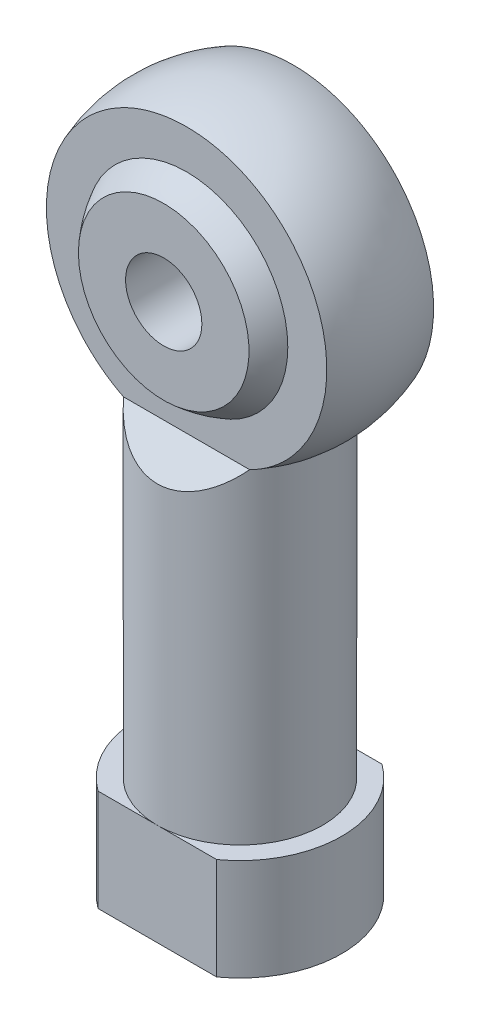
ISO-10303-21;
HEADER;
FILE_DESCRIPTION(('STEP AP214'),'2;1');
FILE_NAME('part.step','',(''),(''),'','','');
FILE_SCHEMA(('AUTOMOTIVE_DESIGN { 1 0 10303 214 1 1 1 1 }'));
ENDSEC;
DATA;
#1=APPLICATION_CONTEXT('core data for automotive mechanical design processes');
#2=APPLICATION_PROTOCOL_DEFINITION('international standard','automotive_design',2000,#1);
#3=PRODUCT_CONTEXT('',#1,'mechanical');
#4=PRODUCT('Part','Part','',(#3));
#5=PRODUCT_RELATED_PRODUCT_CATEGORY('part','',(#4));
#6=PRODUCT_DEFINITION_FORMATION('','',#4);
#7=PRODUCT_DEFINITION_CONTEXT('part definition',#1,'design');
#8=PRODUCT_DEFINITION('design','',#6,#7);
#9=PRODUCT_DEFINITION_SHAPE('','',#8);
#10=(LENGTH_UNIT() NAMED_UNIT(*) SI_UNIT(.MILLI.,.METRE.));
#11=(NAMED_UNIT(*) PLANE_ANGLE_UNIT() SI_UNIT($,.RADIAN.));
#12=(NAMED_UNIT(*) SI_UNIT($,.STERADIAN.) SOLID_ANGLE_UNIT());
#13=UNCERTAINTY_MEASURE_WITH_UNIT(LENGTH_MEASURE(1.E-05),#10,'distance_accuracy_value','');
#14=(GEOMETRIC_REPRESENTATION_CONTEXT(3) GLOBAL_UNCERTAINTY_ASSIGNED_CONTEXT((#13)) GLOBAL_UNIT_ASSIGNED_CONTEXT((#10,
#11,#12)) REPRESENTATION_CONTEXT('',''));
#15=CARTESIAN_POINT('',(0.,0.,0.));
#16=DIRECTION('',(0.,0.,1.));
#17=DIRECTION('',(1.,0.,0.));
#18=AXIS2_PLACEMENT_3D('',#15,#16,#17);
#19=CARTESIAN_POINT('',(-5.90000000000003,0.,2.1));
#20=DIRECTION('',(0.,0.,-1.));
#21=DIRECTION('',(-1.,0.,0.));
#22=AXIS2_PLACEMENT_3D('',#19,#20,#21);
#23=PLANE('',#22);
#24=CARTESIAN_POINT('',(0.,21.7000000000001,2.1));
#25=DIRECTION('',(0.,0.,-1.));
#26=DIRECTION('',(-1.,0.,0.));
#27=AXIS2_PLACEMENT_3D('',#24,#25,#26);
#28=CIRCLE('',#27,5.51361950083612);
#29=CARTESIAN_POINT('',(2.48042335096248,16.7758249421858,2.1));
#30=VERTEX_POINT('',#29);
#31=CARTESIAN_POINT('',(-2.48042335096249,16.7758249421858,2.1));
#32=VERTEX_POINT('',#31);
#33=EDGE_CURVE('E142',#30,#32,#28,.F.);
#34=ORIENTED_EDGE('',*,*,#33,.T.);
#35=DIRECTION('',(1.,0.,0.));
#36=VECTOR('',#35,1.);
#37=CARTESIAN_POINT('',(-5.90000000000003,16.7758249421858,2.1));
#38=LINE('',#37,#36);
#39=EDGE_CURVE('E131',#32,#30,#38,.T.);
#40=ORIENTED_EDGE('',*,*,#39,.T.);
#41=EDGE_LOOP('',(#34,#40));
#42=FACE_BOUND('',#41,.T.);
#43=CARTESIAN_POINT('',(0.,21.7000000000001,2.1));
#44=DIRECTION('',(0.,0.,-1.));
#45=DIRECTION('',(-1.,0.,0.));
#46=AXIS2_PLACEMENT_3D('',#43,#44,#45);
#47=CIRCLE('',#46,3.97994974842648);
#48=CARTESIAN_POINT('',(-3.97994974842648,21.7000000000001,2.1));
#49=VERTEX_POINT('',#48);
#50=EDGE_CURVE('E123',#49,#49,#47,.T.);
#51=ORIENTED_EDGE('',*,*,#50,.T.);
#52=EDGE_LOOP('',(#51));
#53=FACE_BOUND('',#52,.T.);
#54=ADVANCED_FACE('F41',(#42,#53),#23,.F.);
#55=CARTESIAN_POINT('',(-5.90000000000003,9.43791247109279,9.43791247109289));
#56=DIRECTION('',(0.,0.707106781186544,0.707106781186551));
#57=DIRECTION('',(0.,-0.707106781186551,0.707106781186544));
#58=AXIS2_PLACEMENT_3D('',#55,#56,#57);
#59=PLANE('',#58);
#60=CARTESIAN_POINT('',(0.,18.8758249421858,0.));
#61=DIRECTION('',(0.,0.707106781186544,0.707106781186551));
#62=DIRECTION('',(0.,-0.707106781186551,0.707106781186544));
#63=AXIS2_PLACEMENT_3D('',#60,#61,#62);
#64=ELLIPSE('',#63,4.59619407771258,3.25);
#65=EDGE_CURVE('E149',#30,#32,#64,.F.);
#66=ORIENTED_EDGE('',*,*,#65,.F.);
#67=ORIENTED_EDGE('',*,*,#39,.F.);
#68=EDGE_LOOP('',(#66,#67));
#69=FACE_BOUND('',#68,.T.);
#70=ADVANCED_FACE('F195',(#69),#59,.T.);
#71=CARTESIAN_POINT('',(-5.90000000000003,0.,-2.1));
#72=DIRECTION('',(0.,0.,-1.));
#73=DIRECTION('',(-1.,0.,0.));
#74=AXIS2_PLACEMENT_3D('',#71,#72,#73);
#75=PLANE('',#74);
#76=CARTESIAN_POINT('',(0.,21.7000000000001,-2.1));
#77=DIRECTION('',(0.,0.,-1.));
#78=DIRECTION('',(-1.,0.,0.));
#79=AXIS2_PLACEMENT_3D('',#76,#77,#78);
#80=CIRCLE('',#79,3.97994974842648);
#81=CARTESIAN_POINT('',(-3.97994974842648,21.7000000000001,-2.1));
#82=VERTEX_POINT('',#81);
#83=EDGE_CURVE('E145',#82,#82,#80,.T.);
#84=ORIENTED_EDGE('',*,*,#83,.F.);
#85=EDGE_LOOP('',(#84));
#86=FACE_BOUND('',#85,.T.);
#87=DIRECTION('',(1.,0.,0.));
#88=VECTOR('',#87,1.);
#89=CARTESIAN_POINT('',(-5.90000000000003,16.7758249421858,-2.1));
#90=LINE('',#89,#88);
#91=CARTESIAN_POINT('',(-2.48042335096248,16.7758249421858,-2.1));
#92=VERTEX_POINT('',#91);
#93=CARTESIAN_POINT('',(2.48042335096249,16.7758249421858,-2.1));
#94=VERTEX_POINT('',#93);
#95=EDGE_CURVE('E128',#92,#94,#90,.T.);
#96=ORIENTED_EDGE('',*,*,#95,.F.);
#97=CARTESIAN_POINT('',(0.,21.7000000000001,-2.1));
#98=DIRECTION('',(0.,0.,-1.));
#99=DIRECTION('',(-1.,0.,0.));
#100=AXIS2_PLACEMENT_3D('',#97,#98,#99);
#101=CIRCLE('',#100,5.51361950083612);
#102=EDGE_CURVE('E146',#94,#92,#101,.F.);
#103=ORIENTED_EDGE('',*,*,#102,.F.);
#104=EDGE_LOOP('',(#96,#103));
#105=FACE_BOUND('',#104,.T.);
#106=ADVANCED_FACE('F191',(#86,#105),#75,.T.);
#107=CARTESIAN_POINT('',(-5.90000000000003,9.43791247109279,-9.43791247109289));
#108=DIRECTION('',(0.,-0.707106781186544,0.707106781186551));
#109=DIRECTION('',(0.,-0.707106781186551,-0.707106781186544));
#110=AXIS2_PLACEMENT_3D('',#107,#108,#109);
#111=PLANE('',#110);
#112=CARTESIAN_POINT('',(0.,18.8758249421858,0.));
#113=DIRECTION('',(0.,-0.707106781186544,0.707106781186551));
#114=DIRECTION('',(0.,-0.707106781186551,-0.707106781186544));
#115=AXIS2_PLACEMENT_3D('',#112,#113,#114);
#116=ELLIPSE('',#115,4.59619407771258,3.25);
#117=EDGE_CURVE('E151',#94,#92,#116,.F.);
#118=ORIENTED_EDGE('',*,*,#117,.T.);
#119=ORIENTED_EDGE('',*,*,#95,.T.);
#120=EDGE_LOOP('',(#118,#119));
#121=FACE_BOUND('',#120,.T.);
#122=ADVANCED_FACE('F194',(#121),#111,.F.);
#123=CARTESIAN_POINT('',(0.,0.,0.));
#124=DIRECTION('',(0.,-1.,0.));
#125=DIRECTION('',(0.,0.,-1.));
#126=AXIS2_PLACEMENT_3D('',#123,#124,#125);
#127=PLANE('',#126);
#128=CARTESIAN_POINT('',(0.,0.,0.));
#129=DIRECTION('',(0.,-1.,0.));
#130=DIRECTION('',(0.,0.,-1.));
#131=AXIS2_PLACEMENT_3D('',#128,#129,#130);
#132=CIRCLE('',#131,1.24999999999999);
#133=CARTESIAN_POINT('',(0.,0.,-1.24999999999999));
#134=VERTEX_POINT('',#133);
#135=EDGE_CURVE('E113',#134,#134,#132,.T.);
#136=ORIENTED_EDGE('',*,*,#135,.F.);
#137=EDGE_LOOP('',(#136));
#138=FACE_BOUND('',#137,.T.);
#139=CARTESIAN_POINT('',(0.,0.,0.));
#140=DIRECTION('',(0.,-1.,0.));
#141=DIRECTION('',(0.,0.,-1.));
#142=AXIS2_PLACEMENT_3D('',#139,#140,#141);
#143=CIRCLE('',#142,4.);
#144=CARTESIAN_POINT('',(2.33184476327221,0.,-3.25));
#145=VERTEX_POINT('',#144);
#146=CARTESIAN_POINT('',(2.33184476327221,0.,3.25));
#147=VERTEX_POINT('',#146);
#148=EDGE_CURVE('E11',#145,#147,#143,.T.);
#149=ORIENTED_EDGE('',*,*,#148,.T.);
#150=DIRECTION('',(1.,0.,0.));
#151=VECTOR('',#150,1.);
#152=CARTESIAN_POINT('',(-5.90000000000003,0.,3.25));
#153=LINE('',#152,#151);
#154=CARTESIAN_POINT('',(-2.33184476327221,0.,3.25));
#155=VERTEX_POINT('',#154);
#156=EDGE_CURVE('E126',#155,#147,#153,.T.);
#157=ORIENTED_EDGE('',*,*,#156,.F.);
#158=CARTESIAN_POINT('',(-2.33184476327221,0.,-3.25));
#159=VERTEX_POINT('',#158);
#160=EDGE_CURVE('E50',#155,#159,#143,.T.);
#161=ORIENTED_EDGE('',*,*,#160,.T.);
#162=DIRECTION('',(1.,0.,0.));
#163=VECTOR('',#162,1.);
#164=CARTESIAN_POINT('',(-5.90000000000003,0.,-3.25));
#165=LINE('',#164,#163);
#166=EDGE_CURVE('E132',#159,#145,#165,.T.);
#167=ORIENTED_EDGE('',*,*,#166,.T.);
#168=EDGE_LOOP('',(#149,#157,#161,#167));
#169=FACE_BOUND('',#168,.T.);
#170=ADVANCED_FACE('F43',(#138,#169),#127,.T.);
#171=CARTESIAN_POINT('',(0.,0.,0.));
#172=DIRECTION('',(0.,-1.,0.));
#173=DIRECTION('',(0.,0.,-1.));
#174=AXIS2_PLACEMENT_3D('',#171,#172,#173);
#175=CYLINDRICAL_SURFACE('',#174,4.);
#176=ORIENTED_EDGE('',*,*,#160,.F.);
#177=DIRECTION('',(0.,-1.,0.));
#178=VECTOR('',#177,1.);
#179=CARTESIAN_POINT('',(-2.33184476327221,0.,3.25));
#180=LINE('',#179,#178);
#181=CARTESIAN_POINT('',(-2.33184476327221,4.,3.25));
#182=VERTEX_POINT('',#181);
#183=EDGE_CURVE('E159',#155,#182,#180,.F.);
#184=ORIENTED_EDGE('',*,*,#183,.T.);
#185=CARTESIAN_POINT('',(0.,4.,0.));
#186=DIRECTION('',(0.,-1.,0.));
#187=DIRECTION('',(0.,0.,-1.));
#188=AXIS2_PLACEMENT_3D('',#185,#186,#187);
#189=CIRCLE('',#188,4.);
#190=CARTESIAN_POINT('',(-2.33184476327225,4.,-3.24999999999997));
#191=VERTEX_POINT('',#190);
#192=EDGE_CURVE('E169',#182,#191,#189,.T.);
#193=ORIENTED_EDGE('',*,*,#192,.T.);
#194=DIRECTION('',(0.,-1.,0.));
#195=VECTOR('',#194,1.);
#196=CARTESIAN_POINT('',(-2.33184476327221,0.,-3.25));
#197=LINE('',#196,#195);
#198=EDGE_CURVE('E156',#159,#191,#197,.F.);
#199=ORIENTED_EDGE('',*,*,#198,.F.);
#200=EDGE_LOOP('',(#176,#184,#193,#199));
#201=FACE_BOUND('',#200,.T.);
#202=ADVANCED_FACE('F231',(#201),#175,.T.);
#203=CARTESIAN_POINT('',(2.33184476327225,4.,-3.24999999999997));
#204=VERTEX_POINT('',#203);
#205=CARTESIAN_POINT('',(2.33184476327221,4.,3.25));
#206=VERTEX_POINT('',#205);
#207=EDGE_CURVE('E172',#204,#206,#189,.T.);
#208=ORIENTED_EDGE('',*,*,#207,.T.);
#209=DIRECTION('',(0.,-1.,0.));
#210=VECTOR('',#209,1.);
#211=CARTESIAN_POINT('',(2.33184476327221,0.,3.25));
#212=LINE('',#211,#210);
#213=EDGE_CURVE('E58',#206,#147,#212,.T.);
#214=ORIENTED_EDGE('',*,*,#213,.T.);
#215=ORIENTED_EDGE('',*,*,#148,.F.);
#216=DIRECTION('',(0.,-1.,0.));
#217=VECTOR('',#216,1.);
#218=CARTESIAN_POINT('',(2.33184476327221,0.,-3.25));
#219=LINE('',#218,#217);
#220=EDGE_CURVE('E154',#204,#145,#219,.T.);
#221=ORIENTED_EDGE('',*,*,#220,.F.);
#222=EDGE_LOOP('',(#208,#214,#215,#221));
#223=FACE_BOUND('',#222,.T.);
#224=ADVANCED_FACE('F229',(#223),#175,.T.);
#225=CARTESIAN_POINT('',(4.,4.,0.));
#226=DIRECTION('',(0.,1.,0.));
#227=DIRECTION('',(0.,0.,1.));
#228=AXIS2_PLACEMENT_3D('',#225,#226,#227);
#229=PLANE('',#228);
#230=ORIENTED_EDGE('',*,*,#192,.F.);
#231=DIRECTION('',(1.,0.,0.));
#232=VECTOR('',#231,1.);
#233=CARTESIAN_POINT('',(-5.90000000000003,4.,3.25));
#234=LINE('',#233,#232);
#235=CARTESIAN_POINT('',(0.,4.,3.25));
#236=VERTEX_POINT('',#235);
#237=EDGE_CURVE('E137',#182,#236,#234,.T.);
#238=ORIENTED_EDGE('',*,*,#237,.T.);
#239=CARTESIAN_POINT('',(0.,4.,0.));
#240=DIRECTION('',(0.,-1.,0.));
#241=DIRECTION('',(0.,0.,-1.));
#242=AXIS2_PLACEMENT_3D('',#239,#240,#241);
#243=CIRCLE('',#242,3.25);
#244=CARTESIAN_POINT('',(0.,4.,-3.25));
#245=VERTEX_POINT('',#244);
#246=EDGE_CURVE('E170',#236,#245,#243,.T.);
#247=ORIENTED_EDGE('',*,*,#246,.T.);
#248=DIRECTION('',(1.,0.,0.));
#249=VECTOR('',#248,1.);
#250=CARTESIAN_POINT('',(-5.90000000000003,4.,-3.24999999999997));
#251=LINE('',#250,#249);
#252=EDGE_CURVE('E66',#191,#245,#251,.T.);
#253=ORIENTED_EDGE('',*,*,#252,.F.);
#254=EDGE_LOOP('',(#230,#238,#247,#253));
#255=FACE_BOUND('',#254,.T.);
#256=ADVANCED_FACE('F227',(#255),#229,.T.);
#257=EDGE_CURVE('E166',#245,#236,#243,.T.);
#258=ORIENTED_EDGE('',*,*,#257,.T.);
#259=EDGE_CURVE('E138',#236,#206,#234,.T.);
#260=ORIENTED_EDGE('',*,*,#259,.T.);
#261=ORIENTED_EDGE('',*,*,#207,.F.);
#262=EDGE_CURVE('E135',#245,#204,#251,.T.);
#263=ORIENTED_EDGE('',*,*,#262,.F.);
#264=EDGE_LOOP('',(#258,#260,#261,#263));
#265=FACE_BOUND('',#264,.T.);
#266=ADVANCED_FACE('F226',(#265),#229,.T.);
#267=CARTESIAN_POINT('',(0.,0.,0.));
#268=DIRECTION('',(0.,-1.,0.));
#269=DIRECTION('',(0.,0.,-1.));
#270=AXIS2_PLACEMENT_3D('',#267,#268,#269);
#271=CYLINDRICAL_SURFACE('',#270,3.25);
#272=ORIENTED_EDGE('',*,*,#117,.F.);
#273=CARTESIAN_POINT('',(0.,16.7758249421858,0.));
#274=DIRECTION('',(0.,-1.,0.));
#275=DIRECTION('',(0.,0.,-1.));
#276=AXIS2_PLACEMENT_3D('',#273,#274,#275);
#277=CIRCLE('',#276,3.24999999999999);
#278=EDGE_CURVE('E165',#94,#30,#277,.T.);
#279=ORIENTED_EDGE('',*,*,#278,.T.);
#280=ORIENTED_EDGE('',*,*,#65,.T.);
#281=EDGE_CURVE('E162',#32,#92,#277,.T.);
#282=ORIENTED_EDGE('',*,*,#281,.T.);
#283=EDGE_LOOP('',(#272,#279,#280,#282));
#284=FACE_BOUND('',#283,.T.);
#285=ORIENTED_EDGE('',*,*,#257,.F.);
#286=ORIENTED_EDGE('',*,*,#246,.F.);
#287=EDGE_LOOP('',(#285,#286));
#288=FACE_BOUND('',#287,.T.);
#289=ADVANCED_FACE('F206',(#284,#288),#271,.T.);
#290=CARTESIAN_POINT('',(0.,21.7000000000001,0.));
#291=DIRECTION('',(0.,-1.,0.));
#292=DIRECTION('',(1.,0.,0.));
#293=AXIS2_PLACEMENT_3D('',#290,#291,#292);
#294=SPHERICAL_SURFACE('',#293,5.90000000000003);
#295=ORIENTED_EDGE('',*,*,#278,.F.);
#296=ORIENTED_EDGE('',*,*,#102,.T.);
#297=ORIENTED_EDGE('',*,*,#281,.F.);
#298=ORIENTED_EDGE('',*,*,#33,.F.);
#299=EDGE_LOOP('',(#295,#296,#297,#298));
#300=FACE_BOUND('',#299,.T.);
#301=ADVANCED_FACE('F204',(#300),#294,.T.);
#302=CARTESIAN_POINT('',(-5.90000000000003,0.,-3.25));
#303=DIRECTION('',(0.,0.,1.));
#304=DIRECTION('',(0.,-1.,0.));
#305=AXIS2_PLACEMENT_3D('',#302,#303,#304);
#306=PLANE('',#305);
#307=ORIENTED_EDGE('',*,*,#198,.T.);
#308=ORIENTED_EDGE('',*,*,#252,.T.);
#309=ORIENTED_EDGE('',*,*,#262,.T.);
#310=ORIENTED_EDGE('',*,*,#220,.T.);
#311=ORIENTED_EDGE('',*,*,#166,.F.);
#312=EDGE_LOOP('',(#307,#308,#309,#310,#311));
#313=FACE_BOUND('',#312,.T.);
#314=ADVANCED_FACE('F223',(#313),#306,.F.);
#315=CARTESIAN_POINT('',(-5.90000000000003,0.,3.25));
#316=DIRECTION('',(0.,0.,1.));
#317=DIRECTION('',(1.,0.,0.));
#318=AXIS2_PLACEMENT_3D('',#315,#316,#317);
#319=PLANE('',#318);
#320=ORIENTED_EDGE('',*,*,#156,.T.);
#321=ORIENTED_EDGE('',*,*,#213,.F.);
#322=ORIENTED_EDGE('',*,*,#259,.F.);
#323=ORIENTED_EDGE('',*,*,#237,.F.);
#324=ORIENTED_EDGE('',*,*,#183,.F.);
#325=EDGE_LOOP('',(#320,#321,#322,#323,#324));
#326=FACE_BOUND('',#325,.T.);
#327=ADVANCED_FACE('F187',(#326),#319,.T.);
#328=CARTESIAN_POINT('',(0.,21.7000000000001,0.));
#329=DIRECTION('',(0.,1.,0.));
#330=DIRECTION('',(-1.,0.,0.));
#331=AXIS2_PLACEMENT_3D('',#328,#329,#330);
#332=SPHERICAL_SURFACE('',#331,4.5);
#333=CARTESIAN_POINT('',(0.,21.7000000000001,0.));
#334=DIRECTION('',(0.,0.,1.));
#335=DIRECTION('',(1.,0.,0.));
#336=AXIS2_PLACEMENT_3D('',#333,#334,#335);
#337=SPHERICAL_SURFACE('',#336,4.5);
#338=CARTESIAN_POINT('',(0.,21.7000000000001,-3.));
#339=DIRECTION('',(0.,0.,1.));
#340=DIRECTION('',(1.,0.,0.));
#341=AXIS2_PLACEMENT_3D('',#338,#339,#340);
#342=CIRCLE('',#341,3.35410196624969);
#343=CARTESIAN_POINT('',(3.35410196624969,21.7000000000001,-3.));
#344=VERTEX_POINT('',#343);
#345=EDGE_CURVE('E127',#344,#344,#342,.F.);
#346=ORIENTED_EDGE('',*,*,#345,.F.);
#347=EDGE_LOOP('',(#346));
#348=FACE_BOUND('',#347,.T.);
#349=ORIENTED_EDGE('',*,*,#83,.T.);
#350=EDGE_LOOP('',(#349));
#351=FACE_BOUND('',#350,.T.);
#352=ADVANCED_FACE('F183',(#348,#351),#337,.T.);
#353=CARTESIAN_POINT('',(0.,21.7000000000001,0.));
#354=DIRECTION('',(0.,0.,-1.));
#355=DIRECTION('',(-1.,0.,0.));
#356=AXIS2_PLACEMENT_3D('',#353,#354,#355);
#357=SPHERICAL_SURFACE('',#356,4.5);
#358=CARTESIAN_POINT('',(0.,21.7000000000001,3.));
#359=DIRECTION('',(0.,0.,-1.));
#360=DIRECTION('',(-1.,0.,0.));
#361=AXIS2_PLACEMENT_3D('',#358,#359,#360);
#362=CIRCLE('',#361,3.35410196624969);
#363=CARTESIAN_POINT('',(-3.35410196624969,21.7000000000001,3.));
#364=VERTEX_POINT('',#363);
#365=EDGE_CURVE('E122',#364,#364,#362,.F.);
#366=ORIENTED_EDGE('',*,*,#365,.F.);
#367=EDGE_LOOP('',(#366));
#368=FACE_BOUND('',#367,.T.);
#369=ORIENTED_EDGE('',*,*,#50,.F.);
#370=EDGE_LOOP('',(#369));
#371=FACE_BOUND('',#370,.T.);
#372=ADVANCED_FACE('F186',(#368,#371),#357,.T.);
#373=CARTESIAN_POINT('',(-5.90000000000003,18.3458980337504,3.));
#374=DIRECTION('',(0.,0.,-1.));
#375=DIRECTION('',(-1.,0.,0.));
#376=AXIS2_PLACEMENT_3D('',#373,#374,#375);
#377=PLANE('',#376);
#378=CARTESIAN_POINT('',(0.,21.7000000000001,3.));
#379=DIRECTION('',(0.,0.,-1.));
#380=DIRECTION('',(-1.,0.,0.));
#381=AXIS2_PLACEMENT_3D('',#378,#379,#380);
#382=CIRCLE('',#381,1.5);
#383=CARTESIAN_POINT('',(-1.5,21.7000000000001,3.));
#384=VERTEX_POINT('',#383);
#385=EDGE_CURVE('E116',#384,#384,#382,.T.);
#386=ORIENTED_EDGE('',*,*,#385,.T.);
#387=EDGE_LOOP('',(#386));
#388=FACE_BOUND('',#387,.T.);
#389=ORIENTED_EDGE('',*,*,#365,.T.);
#390=EDGE_LOOP('',(#389));
#391=FACE_BOUND('',#390,.T.);
#392=ADVANCED_FACE('F264',(#388,#391),#377,.F.);
#393=CARTESIAN_POINT('',(-5.90000000000003,18.3458980337504,-3.));
#394=DIRECTION('',(0.,0.,1.));
#395=DIRECTION('',(1.,0.,0.));
#396=AXIS2_PLACEMENT_3D('',#393,#394,#395);
#397=PLANE('',#396);
#398=CARTESIAN_POINT('',(0.,21.7000000000001,-3.));
#399=DIRECTION('',(0.,0.,1.));
#400=DIRECTION('',(1.,0.,0.));
#401=AXIS2_PLACEMENT_3D('',#398,#399,#400);
#402=CIRCLE('',#401,1.5);
#403=CARTESIAN_POINT('',(1.5,21.7000000000001,-3.));
#404=VERTEX_POINT('',#403);
#405=EDGE_CURVE('E45',#404,#404,#402,.T.);
#406=ORIENTED_EDGE('',*,*,#405,.T.);
#407=EDGE_LOOP('',(#406));
#408=FACE_BOUND('',#407,.T.);
#409=ORIENTED_EDGE('',*,*,#345,.T.);
#410=EDGE_LOOP('',(#409));
#411=FACE_BOUND('',#410,.T.);
#412=ADVANCED_FACE('F181',(#408,#411),#397,.F.);
#413=CARTESIAN_POINT('',(0.,21.7000000000001,-3.25));
#414=DIRECTION('',(0.,0.,1.));
#415=DIRECTION('',(1.,0.,0.));
#416=AXIS2_PLACEMENT_3D('',#413,#414,#415);
#417=CYLINDRICAL_SURFACE('',#416,1.5);
#418=ORIENTED_EDGE('',*,*,#405,.F.);
#419=EDGE_LOOP('',(#418));
#420=FACE_BOUND('',#419,.T.);
#421=ORIENTED_EDGE('',*,*,#385,.F.);
#422=EDGE_LOOP('',(#421));
#423=FACE_BOUND('',#422,.T.);
#424=ADVANCED_FACE('F107',(#420,#423),#417,.F.);
#425=CARTESIAN_POINT('',(0.,14.,0.));
#426=DIRECTION('',(0.,-1.,0.));
#427=DIRECTION('',(0.,0.,-1.));
#428=AXIS2_PLACEMENT_3D('',#425,#426,#427);
#429=CONICAL_SURFACE('',#428,1.25,1.02974425867665);
#430=CARTESIAN_POINT('',(0.,14.7510757737845,0.));
#431=VERTEX_POINT('',#430);
#432=VERTEX_LOOP('',#431);
#433=FACE_BOUND('',#432,.T.);
#434=CARTESIAN_POINT('',(0.,14.,0.));
#435=DIRECTION('',(0.,-1.,0.));
#436=DIRECTION('',(0.,0.,-1.));
#437=AXIS2_PLACEMENT_3D('',#434,#435,#436);
#438=CIRCLE('',#437,1.25);
#439=CARTESIAN_POINT('',(0.,14.,-1.25));
#440=VERTEX_POINT('',#439);
#441=EDGE_CURVE('E111',#440,#440,#438,.T.);
#442=ORIENTED_EDGE('',*,*,#441,.T.);
#443=EDGE_LOOP('',(#442));
#444=FACE_BOUND('',#443,.T.);
#445=ADVANCED_FACE('F103',(#433,#444),#429,.F.);
#446=CARTESIAN_POINT('',(0.,0.,0.));
#447=DIRECTION('',(0.,-1.,0.));
#448=DIRECTION('',(0.,0.,-1.));
#449=AXIS2_PLACEMENT_3D('',#446,#447,#448);
#450=CYLINDRICAL_SURFACE('',#449,1.24999999999999);
#451=ORIENTED_EDGE('',*,*,#441,.F.);
#452=EDGE_LOOP('',(#451));
#453=FACE_BOUND('',#452,.T.);
#454=ORIENTED_EDGE('',*,*,#135,.T.);
#455=EDGE_LOOP('',(#454));
#456=FACE_BOUND('',#455,.T.);
#457=ADVANCED_FACE('F106',(#453,#456),#450,.F.);
#458=CLOSED_SHELL('',(#54,#70,#106,#122,#170,#202,#224,#256,#266,#289,#301,#314,#327,#352,#372,
#392,#412,#424,#445,#457));
#459=MANIFOLD_SOLID_BREP('B2',#458);
#460=ADVANCED_BREP_SHAPE_REPRESENTATION('',(#18,#459),#14);
#461=SHAPE_DEFINITION_REPRESENTATION(#9,#460);
ENDSEC;
END-ISO-10303-21;
